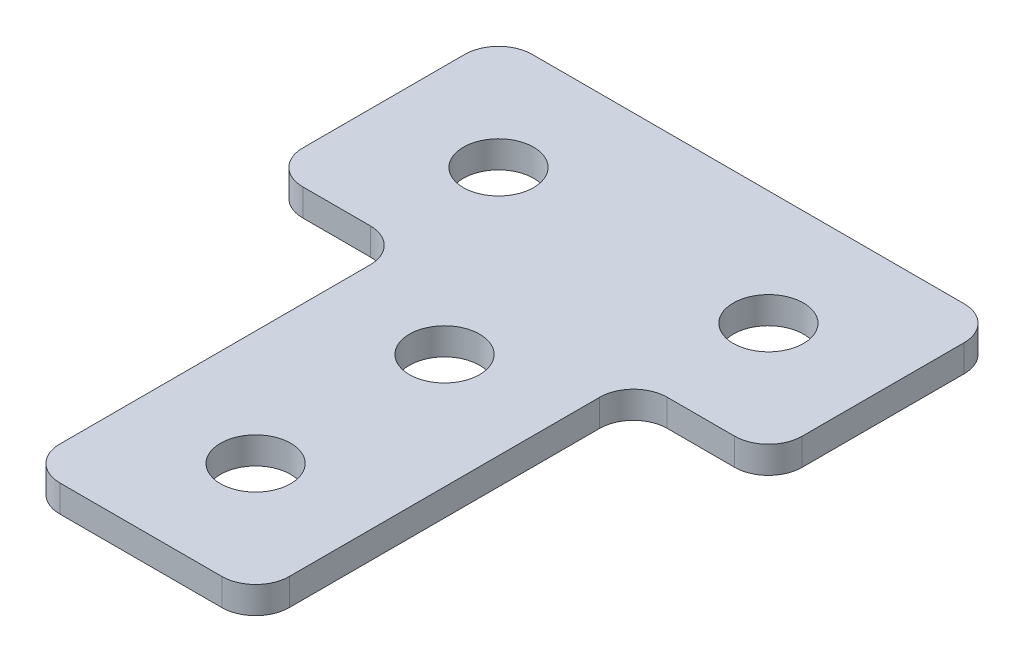
ISO-10303-21;
HEADER;
FILE_DESCRIPTION(('STEP AP214'),'2;1');
FILE_NAME('part.step','',(''),(''),'','','');
FILE_SCHEMA(('AUTOMOTIVE_DESIGN { 1 0 10303 214 1 1 1 1 }'));
ENDSEC;
DATA;
#1=APPLICATION_CONTEXT('core data for automotive mechanical design processes');
#2=APPLICATION_PROTOCOL_DEFINITION('international standard','automotive_design',2000,#1);
#3=PRODUCT_CONTEXT('',#1,'mechanical');
#4=PRODUCT('Part','Part','',(#3));
#5=PRODUCT_RELATED_PRODUCT_CATEGORY('part','',(#4));
#6=PRODUCT_DEFINITION_FORMATION('','',#4);
#7=PRODUCT_DEFINITION_CONTEXT('part definition',#1,'design');
#8=PRODUCT_DEFINITION('design','',#6,#7);
#9=PRODUCT_DEFINITION_SHAPE('','',#8);
#10=(LENGTH_UNIT() NAMED_UNIT(*) SI_UNIT(.MILLI.,.METRE.));
#11=(NAMED_UNIT(*) PLANE_ANGLE_UNIT() SI_UNIT($,.RADIAN.));
#12=(NAMED_UNIT(*) SI_UNIT($,.STERADIAN.) SOLID_ANGLE_UNIT());
#13=UNCERTAINTY_MEASURE_WITH_UNIT(LENGTH_MEASURE(1.E-05),#10,'distance_accuracy_value','');
#14=(GEOMETRIC_REPRESENTATION_CONTEXT(3) GLOBAL_UNCERTAINTY_ASSIGNED_CONTEXT((#13)) GLOBAL_UNIT_ASSIGNED_CONTEXT((#10,
#11,#12)) REPRESENTATION_CONTEXT('',''));
#15=CARTESIAN_POINT('',(0.,0.,0.));
#16=DIRECTION('',(0.,0.,1.));
#17=DIRECTION('',(1.,0.,0.));
#18=AXIS2_PLACEMENT_3D('',#15,#16,#17);
#19=CARTESIAN_POINT('',(30.5676190476191,-1.,-16.4609523809523));
#20=DIRECTION('',(0.,-1.,0.));
#21=DIRECTION('',(0.,0.,-1.));
#22=AXIS2_PLACEMENT_3D('',#19,#20,#21);
#23=PLANE('',#22);
#24=CARTESIAN_POINT('',(30.5676190476191,-1.,-2.46095238095234));
#25=DIRECTION('',(0.,1.,0.));
#26=DIRECTION('',(0.,0.,1.));
#27=AXIS2_PLACEMENT_3D('',#24,#25,#26);
#28=CIRCLE('',#27,2.6);
#29=CARTESIAN_POINT('',(30.5676190476191,-1.,0.139047619047657));
#30=VERTEX_POINT('',#29);
#31=EDGE_CURVE('E265',#30,#30,#28,.T.);
#32=ORIENTED_EDGE('',*,*,#31,.T.);
#33=EDGE_LOOP('',(#32));
#34=FACE_BOUND('',#33,.T.);
#35=DIRECTION('',(0.,0.,-1.));
#36=VECTOR('',#35,1.);
#37=CARTESIAN_POINT('',(49.067619047619,-1.,-7.96095238095231));
#38=LINE('',#37,#36);
#39=CARTESIAN_POINT('',(49.067619047619,-1.,-10.4609523809523));
#40=VERTEX_POINT('',#39);
#41=CARTESIAN_POINT('',(49.067619047619,-1.,-22.4609523809524));
#42=VERTEX_POINT('',#41);
#43=EDGE_CURVE('E279',#40,#42,#38,.T.);
#44=ORIENTED_EDGE('',*,*,#43,.F.);
#45=CARTESIAN_POINT('',(46.567619047619,-1.,-10.4609523809523));
#46=DIRECTION('',(0.,-1.,0.));
#47=DIRECTION('',(0.,0.,-1.));
#48=AXIS2_PLACEMENT_3D('',#45,#46,#47);
#49=CIRCLE('',#48,2.5);
#50=CARTESIAN_POINT('',(46.567619047619,-1.,-7.96095238095231));
#51=VERTEX_POINT('',#50);
#52=EDGE_CURVE('E190',#40,#51,#49,.T.);
#53=ORIENTED_EDGE('',*,*,#52,.T.);
#54=DIRECTION('',(1.,0.,0.));
#55=VECTOR('',#54,1.);
#56=CARTESIAN_POINT('',(39.0676190476191,-1.,-7.96095238095231));
#57=LINE('',#56,#55);
#58=CARTESIAN_POINT('',(41.5676190476191,-1.,-7.96095238095231));
#59=VERTEX_POINT('',#58);
#60=EDGE_CURVE('E153',#59,#51,#57,.T.);
#61=ORIENTED_EDGE('',*,*,#60,.F.);
#62=CARTESIAN_POINT('',(41.5676190476191,-1.,-5.46095238095231));
#63=DIRECTION('',(0.,-1.,0.));
#64=DIRECTION('',(0.,0.,-1.));
#65=AXIS2_PLACEMENT_3D('',#62,#63,#64);
#66=CIRCLE('',#65,2.5);
#67=CARTESIAN_POINT('',(39.0676190476191,-1.,-5.4609523809523));
#68=VERTEX_POINT('',#67);
#69=EDGE_CURVE('E217',#59,#68,#66,.F.);
#70=ORIENTED_EDGE('',*,*,#69,.T.);
#71=DIRECTION('',(0.,0.,-1.));
#72=VECTOR('',#71,1.);
#73=CARTESIAN_POINT('',(39.0676190476191,-1.,20.0390476190476));
#74=LINE('',#73,#72);
#75=CARTESIAN_POINT('',(39.0676190476191,-1.,17.5390476190476));
#76=VERTEX_POINT('',#75);
#77=EDGE_CURVE('E157',#76,#68,#74,.T.);
#78=ORIENTED_EDGE('',*,*,#77,.F.);
#79=CARTESIAN_POINT('',(36.5676190476191,-1.,17.5390476190476));
#80=DIRECTION('',(0.,-1.,0.));
#81=DIRECTION('',(0.,0.,-1.));
#82=AXIS2_PLACEMENT_3D('',#79,#80,#81);
#83=CIRCLE('',#82,2.5);
#84=CARTESIAN_POINT('',(36.5676190476191,-1.,20.0390476190476));
#85=VERTEX_POINT('',#84);
#86=EDGE_CURVE('E156',#76,#85,#83,.T.);
#87=ORIENTED_EDGE('',*,*,#86,.T.);
#88=DIRECTION('',(1.,0.,0.));
#89=VECTOR('',#88,1.);
#90=CARTESIAN_POINT('',(22.067619047619,-1.,20.0390476190476));
#91=LINE('',#90,#89);
#92=CARTESIAN_POINT('',(24.567619047619,-1.,20.0390476190476));
#93=VERTEX_POINT('',#92);
#94=EDGE_CURVE('E161',#93,#85,#91,.T.);
#95=ORIENTED_EDGE('',*,*,#94,.F.);
#96=CARTESIAN_POINT('',(24.567619047619,-1.,17.5390476190476));
#97=DIRECTION('',(0.,-1.,0.));
#98=DIRECTION('',(0.,0.,-1.));
#99=AXIS2_PLACEMENT_3D('',#96,#97,#98);
#100=CIRCLE('',#99,2.5);
#101=CARTESIAN_POINT('',(22.067619047619,-1.,17.5390476190476));
#102=VERTEX_POINT('',#101);
#103=EDGE_CURVE('E183',#93,#102,#100,.T.);
#104=ORIENTED_EDGE('',*,*,#103,.T.);
#105=DIRECTION('',(0.,0.,-1.));
#106=VECTOR('',#105,1.);
#107=CARTESIAN_POINT('',(22.067619047619,-1.,20.0390476190476));
#108=LINE('',#107,#106);
#109=CARTESIAN_POINT('',(22.067619047619,-1.,-5.4609523809523));
#110=VERTEX_POINT('',#109);
#111=EDGE_CURVE('E242',#102,#110,#108,.T.);
#112=ORIENTED_EDGE('',*,*,#111,.T.);
#113=CARTESIAN_POINT('',(19.567619047619,-1.,-5.4609523809523));
#114=DIRECTION('',(0.,-1.,0.));
#115=DIRECTION('',(0.,0.,-1.));
#116=AXIS2_PLACEMENT_3D('',#113,#114,#115);
#117=CIRCLE('',#116,2.5);
#118=CARTESIAN_POINT('',(19.567619047619,-1.,-7.96095238095231));
#119=VERTEX_POINT('',#118);
#120=EDGE_CURVE('E10',#110,#119,#117,.F.);
#121=ORIENTED_EDGE('',*,*,#120,.T.);
#122=DIRECTION('',(-1.,0.,0.));
#123=VECTOR('',#122,1.);
#124=CARTESIAN_POINT('',(22.067619047619,-1.,-7.96095238095231));
#125=LINE('',#124,#123);
#126=CARTESIAN_POINT('',(14.5676190476191,-1.,-7.9609523809523));
#127=VERTEX_POINT('',#126);
#128=EDGE_CURVE('E232',#119,#127,#125,.T.);
#129=ORIENTED_EDGE('',*,*,#128,.T.);
#130=CARTESIAN_POINT('',(14.5676190476191,-1.,-10.4609523809523));
#131=DIRECTION('',(0.,-1.,0.));
#132=DIRECTION('',(0.,0.,-1.));
#133=AXIS2_PLACEMENT_3D('',#130,#131,#132);
#134=CIRCLE('',#133,2.5);
#135=CARTESIAN_POINT('',(12.0676190476191,-1.,-10.4609523809523));
#136=VERTEX_POINT('',#135);
#137=EDGE_CURVE('E185',#127,#136,#134,.T.);
#138=ORIENTED_EDGE('',*,*,#137,.T.);
#139=DIRECTION('',(0.,0.,-1.));
#140=VECTOR('',#139,1.);
#141=CARTESIAN_POINT('',(12.0676190476191,-1.,-7.9609523809523));
#142=LINE('',#141,#140);
#143=CARTESIAN_POINT('',(12.0676190476191,-1.,-22.4609523809524));
#144=VERTEX_POINT('',#143);
#145=EDGE_CURVE('E246',#136,#144,#142,.T.);
#146=ORIENTED_EDGE('',*,*,#145,.T.);
#147=CARTESIAN_POINT('',(14.5676190476191,-1.,-22.4609523809524));
#148=DIRECTION('',(0.,-1.,0.));
#149=DIRECTION('',(0.,0.,-1.));
#150=AXIS2_PLACEMENT_3D('',#147,#148,#149);
#151=CIRCLE('',#150,2.5);
#152=CARTESIAN_POINT('',(14.5676190476191,-1.,-24.9609523809524));
#153=VERTEX_POINT('',#152);
#154=EDGE_CURVE('E31',#144,#153,#151,.T.);
#155=ORIENTED_EDGE('',*,*,#154,.T.);
#156=DIRECTION('',(-1.,0.,0.));
#157=VECTOR('',#156,1.);
#158=CARTESIAN_POINT('',(49.067619047619,-1.,-24.9609523809524));
#159=LINE('',#158,#157);
#160=CARTESIAN_POINT('',(46.567619047619,-1.,-24.9609523809524));
#161=VERTEX_POINT('',#160);
#162=EDGE_CURVE('E282',#161,#153,#159,.T.);
#163=ORIENTED_EDGE('',*,*,#162,.F.);
#164=CARTESIAN_POINT('',(46.567619047619,-1.,-22.4609523809524));
#165=DIRECTION('',(0.,-1.,0.));
#166=DIRECTION('',(0.,0.,-1.));
#167=AXIS2_PLACEMENT_3D('',#164,#165,#166);
#168=CIRCLE('',#167,2.5);
#169=EDGE_CURVE('E188',#161,#42,#168,.T.);
#170=ORIENTED_EDGE('',*,*,#169,.T.);
#171=EDGE_LOOP('',(#44,#53,#61,#70,#78,#87,#95,#104,#112,#121,#129,#138,#146,#155,#163,#170));
#172=FACE_BOUND('',#171,.T.);
#173=CARTESIAN_POINT('',(30.5676190476191,-1.,11.5390476190477));
#174=DIRECTION('',(0.,1.,0.));
#175=DIRECTION('',(0.,0.,1.));
#176=AXIS2_PLACEMENT_3D('',#173,#174,#175);
#177=CIRCLE('',#176,2.6);
#178=CARTESIAN_POINT('',(30.5676190476191,-1.,14.1390476190477));
#179=VERTEX_POINT('',#178);
#180=EDGE_CURVE('E259',#179,#179,#177,.T.);
#181=ORIENTED_EDGE('',*,*,#180,.T.);
#182=EDGE_LOOP('',(#181));
#183=FACE_BOUND('',#182,.T.);
#184=CARTESIAN_POINT('',(40.5676190476191,-1.,-16.4609523809523));
#185=DIRECTION('',(0.,1.,0.));
#186=DIRECTION('',(0.,0.,1.));
#187=AXIS2_PLACEMENT_3D('',#184,#185,#186);
#188=CIRCLE('',#187,2.6);
#189=CARTESIAN_POINT('',(40.5676190476191,-1.,-13.8609523809523));
#190=VERTEX_POINT('',#189);
#191=EDGE_CURVE('E271',#190,#190,#188,.T.);
#192=ORIENTED_EDGE('',*,*,#191,.T.);
#193=EDGE_LOOP('',(#192));
#194=FACE_BOUND('',#193,.T.);
#195=CARTESIAN_POINT('',(20.5676190476191,-1.,-16.4609523809523));
#196=DIRECTION('',(0.,-1.,0.));
#197=DIRECTION('',(0.,0.,1.));
#198=AXIS2_PLACEMENT_3D('',#195,#196,#197);
#199=CIRCLE('',#198,2.6);
#200=CARTESIAN_POINT('',(20.5676190476191,-1.,-13.8609523809523));
#201=VERTEX_POINT('',#200);
#202=EDGE_CURVE('E256',#201,#201,#199,.T.);
#203=ORIENTED_EDGE('',*,*,#202,.F.);
#204=EDGE_LOOP('',(#203));
#205=FACE_BOUND('',#204,.T.);
#206=ADVANCED_FACE('F16',(#34,#172,#183,#194,#205),#23,.T.);
#207=CARTESIAN_POINT('',(39.0676190476191,-1.,-7.96095238095231));
#208=DIRECTION('',(0.,0.,1.));
#209=DIRECTION('',(1.,0.,0.));
#210=AXIS2_PLACEMENT_3D('',#207,#208,#209);
#211=PLANE('',#210);
#212=DIRECTION('',(1.,0.,0.));
#213=VECTOR('',#212,1.);
#214=CARTESIAN_POINT('',(39.0676190476191,1.,-7.96095238095231));
#215=LINE('',#214,#213);
#216=CARTESIAN_POINT('',(41.5676190476191,1.,-7.96095238095231));
#217=VERTEX_POINT('',#216);
#218=CARTESIAN_POINT('',(46.567619047619,1.,-7.96095238095231));
#219=VERTEX_POINT('',#218);
#220=EDGE_CURVE('E274',#217,#219,#215,.T.);
#221=ORIENTED_EDGE('',*,*,#220,.F.);
#222=DIRECTION('',(0.,1.,0.));
#223=VECTOR('',#222,1.);
#224=CARTESIAN_POINT('',(41.5676190476191,-1.,-7.96095238095231));
#225=LINE('',#224,#223);
#226=EDGE_CURVE('E143',#217,#59,#225,.F.);
#227=ORIENTED_EDGE('',*,*,#226,.T.);
#228=ORIENTED_EDGE('',*,*,#60,.T.);
#229=DIRECTION('',(0.,1.,0.));
#230=VECTOR('',#229,1.);
#231=CARTESIAN_POINT('',(46.567619047619,-1.,-7.96095238095231));
#232=LINE('',#231,#230);
#233=EDGE_CURVE('E159',#51,#219,#232,.T.);
#234=ORIENTED_EDGE('',*,*,#233,.T.);
#235=EDGE_LOOP('',(#221,#227,#228,#234));
#236=FACE_BOUND('',#235,.T.);
#237=ADVANCED_FACE('F311',(#236),#211,.T.);
#238=CARTESIAN_POINT('',(39.0676190476191,-1.,20.0390476190476));
#239=DIRECTION('',(1.,0.,0.));
#240=DIRECTION('',(0.,0.,-1.));
#241=AXIS2_PLACEMENT_3D('',#238,#239,#240);
#242=PLANE('',#241);
#243=ORIENTED_EDGE('',*,*,#77,.T.);
#244=DIRECTION('',(0.,1.,0.));
#245=VECTOR('',#244,1.);
#246=CARTESIAN_POINT('',(39.0676190476191,1.,-5.46095238095231));
#247=LINE('',#246,#245);
#248=CARTESIAN_POINT('',(39.0676190476191,1.,-5.4609523809523));
#249=VERTEX_POINT('',#248);
#250=EDGE_CURVE('E152',#68,#249,#247,.T.);
#251=ORIENTED_EDGE('',*,*,#250,.T.);
#252=DIRECTION('',(0.,0.,-1.));
#253=VECTOR('',#252,1.);
#254=CARTESIAN_POINT('',(39.0676190476191,1.,20.0390476190476));
#255=LINE('',#254,#253);
#256=CARTESIAN_POINT('',(39.0676190476191,1.,17.5390476190476));
#257=VERTEX_POINT('',#256);
#258=EDGE_CURVE('E135',#257,#249,#255,.T.);
#259=ORIENTED_EDGE('',*,*,#258,.F.);
#260=DIRECTION('',(0.,1.,0.));
#261=VECTOR('',#260,1.);
#262=CARTESIAN_POINT('',(39.0676190476191,-1.,17.5390476190476));
#263=LINE('',#262,#261);
#264=EDGE_CURVE('E149',#257,#76,#263,.F.);
#265=ORIENTED_EDGE('',*,*,#264,.T.);
#266=EDGE_LOOP('',(#243,#251,#259,#265));
#267=FACE_BOUND('',#266,.T.);
#268=ADVANCED_FACE('F148',(#267),#242,.T.);
#269=CARTESIAN_POINT('',(22.067619047619,-1.,20.0390476190476));
#270=DIRECTION('',(0.,0.,1.));
#271=DIRECTION('',(1.,0.,0.));
#272=AXIS2_PLACEMENT_3D('',#269,#270,#271);
#273=PLANE('',#272);
#274=DIRECTION('',(1.,0.,0.));
#275=VECTOR('',#274,1.);
#276=CARTESIAN_POINT('',(22.067619047619,1.,20.0390476190476));
#277=LINE('',#276,#275);
#278=CARTESIAN_POINT('',(24.567619047619,1.,20.0390476190476));
#279=VERTEX_POINT('',#278);
#280=CARTESIAN_POINT('',(36.5676190476191,1.,20.0390476190476));
#281=VERTEX_POINT('',#280);
#282=EDGE_CURVE('E137',#279,#281,#277,.T.);
#283=ORIENTED_EDGE('',*,*,#282,.F.);
#284=DIRECTION('',(0.,1.,0.));
#285=VECTOR('',#284,1.);
#286=CARTESIAN_POINT('',(24.567619047619,-1.,20.0390476190476));
#287=LINE('',#286,#285);
#288=EDGE_CURVE('E213',#279,#93,#287,.F.);
#289=ORIENTED_EDGE('',*,*,#288,.T.);
#290=ORIENTED_EDGE('',*,*,#94,.T.);
#291=DIRECTION('',(0.,1.,0.));
#292=VECTOR('',#291,1.);
#293=CARTESIAN_POINT('',(36.5676190476191,-1.,20.0390476190476));
#294=LINE('',#293,#292);
#295=EDGE_CURVE('E211',#85,#281,#294,.T.);
#296=ORIENTED_EDGE('',*,*,#295,.T.);
#297=EDGE_LOOP('',(#283,#289,#290,#296));
#298=FACE_BOUND('',#297,.T.);
#299=ADVANCED_FACE('F318',(#298),#273,.T.);
#300=CARTESIAN_POINT('',(49.067619047619,-1.,-24.9609523809524));
#301=DIRECTION('',(0.,0.,-1.));
#302=DIRECTION('',(-1.,0.,0.));
#303=AXIS2_PLACEMENT_3D('',#300,#301,#302);
#304=PLANE('',#303);
#305=DIRECTION('',(-1.,0.,0.));
#306=VECTOR('',#305,1.);
#307=CARTESIAN_POINT('',(49.067619047619,1.,-24.9609523809524));
#308=LINE('',#307,#306);
#309=CARTESIAN_POINT('',(46.567619047619,1.,-24.9609523809524));
#310=VERTEX_POINT('',#309);
#311=CARTESIAN_POINT('',(14.5676190476191,1.,-24.9609523809524));
#312=VERTEX_POINT('',#311);
#313=EDGE_CURVE('E290',#310,#312,#308,.T.);
#314=ORIENTED_EDGE('',*,*,#313,.F.);
#315=DIRECTION('',(0.,1.,0.));
#316=VECTOR('',#315,1.);
#317=CARTESIAN_POINT('',(46.567619047619,-1.,-24.9609523809524));
#318=LINE('',#317,#316);
#319=EDGE_CURVE('E38',#310,#161,#318,.F.);
#320=ORIENTED_EDGE('',*,*,#319,.T.);
#321=ORIENTED_EDGE('',*,*,#162,.T.);
#322=DIRECTION('',(0.,1.,0.));
#323=VECTOR('',#322,1.);
#324=CARTESIAN_POINT('',(14.5676190476191,-1.,-24.9609523809524));
#325=LINE('',#324,#323);
#326=EDGE_CURVE('E192',#153,#312,#325,.T.);
#327=ORIENTED_EDGE('',*,*,#326,.T.);
#328=EDGE_LOOP('',(#314,#320,#321,#327));
#329=FACE_BOUND('',#328,.T.);
#330=ADVANCED_FACE('F293',(#329),#304,.T.);
#331=CARTESIAN_POINT('',(49.067619047619,-1.,-7.96095238095231));
#332=DIRECTION('',(1.,0.,0.));
#333=DIRECTION('',(0.,0.,-1.));
#334=AXIS2_PLACEMENT_3D('',#331,#332,#333);
#335=PLANE('',#334);
#336=DIRECTION('',(0.,0.,-1.));
#337=VECTOR('',#336,1.);
#338=CARTESIAN_POINT('',(49.067619047619,1.,-7.96095238095231));
#339=LINE('',#338,#337);
#340=CARTESIAN_POINT('',(49.067619047619,1.,-10.4609523809523));
#341=VERTEX_POINT('',#340);
#342=CARTESIAN_POINT('',(49.067619047619,1.,-22.4609523809524));
#343=VERTEX_POINT('',#342);
#344=EDGE_CURVE('E287',#341,#343,#339,.T.);
#345=ORIENTED_EDGE('',*,*,#344,.F.);
#346=DIRECTION('',(0.,1.,0.));
#347=VECTOR('',#346,1.);
#348=CARTESIAN_POINT('',(49.067619047619,-1.,-10.4609523809523));
#349=LINE('',#348,#347);
#350=EDGE_CURVE('E180',#341,#40,#349,.F.);
#351=ORIENTED_EDGE('',*,*,#350,.T.);
#352=ORIENTED_EDGE('',*,*,#43,.T.);
#353=DIRECTION('',(0.,1.,0.));
#354=VECTOR('',#353,1.);
#355=CARTESIAN_POINT('',(49.067619047619,-1.,-22.4609523809524));
#356=LINE('',#355,#354);
#357=EDGE_CURVE('E177',#42,#343,#356,.T.);
#358=ORIENTED_EDGE('',*,*,#357,.T.);
#359=EDGE_LOOP('',(#345,#351,#352,#358));
#360=FACE_BOUND('',#359,.T.);
#361=ADVANCED_FACE('F302',(#360),#335,.T.);
#362=CARTESIAN_POINT('',(30.5676190476191,1.,-16.4609523809523));
#363=DIRECTION('',(0.,-1.,0.));
#364=DIRECTION('',(0.,0.,-1.));
#365=AXIS2_PLACEMENT_3D('',#362,#363,#364);
#366=PLANE('',#365);
#367=CARTESIAN_POINT('',(30.5676190476191,1.,-2.46095238095234));
#368=DIRECTION('',(0.,1.,0.));
#369=DIRECTION('',(0.,0.,1.));
#370=AXIS2_PLACEMENT_3D('',#367,#368,#369);
#371=CIRCLE('',#370,2.6);
#372=CARTESIAN_POINT('',(30.5676190476191,1.,0.139047619047657));
#373=VERTEX_POINT('',#372);
#374=EDGE_CURVE('E262',#373,#373,#371,.T.);
#375=ORIENTED_EDGE('',*,*,#374,.F.);
#376=EDGE_LOOP('',(#375));
#377=FACE_BOUND('',#376,.T.);
#378=ORIENTED_EDGE('',*,*,#220,.T.);
#379=CARTESIAN_POINT('',(46.567619047619,1.,-10.4609523809523));
#380=DIRECTION('',(0.,-1.,0.));
#381=DIRECTION('',(0.,0.,-1.));
#382=AXIS2_PLACEMENT_3D('',#379,#380,#381);
#383=CIRCLE('',#382,2.5);
#384=EDGE_CURVE('E175',#219,#341,#383,.F.);
#385=ORIENTED_EDGE('',*,*,#384,.T.);
#386=ORIENTED_EDGE('',*,*,#344,.T.);
#387=CARTESIAN_POINT('',(46.567619047619,1.,-22.4609523809524));
#388=DIRECTION('',(0.,-1.,0.));
#389=DIRECTION('',(0.,0.,-1.));
#390=AXIS2_PLACEMENT_3D('',#387,#388,#389);
#391=CIRCLE('',#390,2.5);
#392=EDGE_CURVE('E173',#343,#310,#391,.F.);
#393=ORIENTED_EDGE('',*,*,#392,.T.);
#394=ORIENTED_EDGE('',*,*,#313,.T.);
#395=CARTESIAN_POINT('',(14.5676190476191,1.,-22.4609523809524));
#396=DIRECTION('',(0.,-1.,0.));
#397=DIRECTION('',(0.,0.,-1.));
#398=AXIS2_PLACEMENT_3D('',#395,#396,#397);
#399=CIRCLE('',#398,2.5);
#400=CARTESIAN_POINT('',(12.0676190476191,1.,-22.4609523809524));
#401=VERTEX_POINT('',#400);
#402=EDGE_CURVE('E171',#312,#401,#399,.F.);
#403=ORIENTED_EDGE('',*,*,#402,.T.);
#404=DIRECTION('',(0.,0.,-1.));
#405=VECTOR('',#404,1.);
#406=CARTESIAN_POINT('',(12.0676190476191,1.,-7.9609523809523));
#407=LINE('',#406,#405);
#408=CARTESIAN_POINT('',(12.0676190476191,1.,-10.4609523809523));
#409=VERTEX_POINT('',#408);
#410=EDGE_CURVE('E233',#409,#401,#407,.T.);
#411=ORIENTED_EDGE('',*,*,#410,.F.);
#412=CARTESIAN_POINT('',(14.5676190476191,1.,-10.4609523809523));
#413=DIRECTION('',(0.,-1.,0.));
#414=DIRECTION('',(0.,0.,-1.));
#415=AXIS2_PLACEMENT_3D('',#412,#413,#414);
#416=CIRCLE('',#415,2.5);
#417=CARTESIAN_POINT('',(14.5676190476191,1.,-7.9609523809523));
#418=VERTEX_POINT('',#417);
#419=EDGE_CURVE('E169',#409,#418,#416,.F.);
#420=ORIENTED_EDGE('',*,*,#419,.T.);
#421=DIRECTION('',(-1.,0.,0.));
#422=VECTOR('',#421,1.);
#423=CARTESIAN_POINT('',(22.067619047619,1.,-7.96095238095231));
#424=LINE('',#423,#422);
#425=CARTESIAN_POINT('',(19.567619047619,1.,-7.96095238095231));
#426=VERTEX_POINT('',#425);
#427=EDGE_CURVE('E223',#426,#418,#424,.T.);
#428=ORIENTED_EDGE('',*,*,#427,.F.);
#429=CARTESIAN_POINT('',(19.567619047619,1.,-5.4609523809523));
#430=DIRECTION('',(0.,-1.,0.));
#431=DIRECTION('',(0.,0.,-1.));
#432=AXIS2_PLACEMENT_3D('',#429,#430,#431);
#433=CIRCLE('',#432,2.5);
#434=CARTESIAN_POINT('',(22.067619047619,1.,-5.4609523809523));
#435=VERTEX_POINT('',#434);
#436=EDGE_CURVE('E24',#426,#435,#433,.T.);
#437=ORIENTED_EDGE('',*,*,#436,.T.);
#438=DIRECTION('',(0.,0.,-1.));
#439=VECTOR('',#438,1.);
#440=CARTESIAN_POINT('',(22.067619047619,1.,20.0390476190476));
#441=LINE('',#440,#439);
#442=CARTESIAN_POINT('',(22.067619047619,1.,17.5390476190476));
#443=VERTEX_POINT('',#442);
#444=EDGE_CURVE('E221',#443,#435,#441,.T.);
#445=ORIENTED_EDGE('',*,*,#444,.F.);
#446=CARTESIAN_POINT('',(24.567619047619,1.,17.5390476190476));
#447=DIRECTION('',(0.,-1.,0.));
#448=DIRECTION('',(0.,0.,-1.));
#449=AXIS2_PLACEMENT_3D('',#446,#447,#448);
#450=CIRCLE('',#449,2.5);
#451=EDGE_CURVE('E142',#443,#279,#450,.F.);
#452=ORIENTED_EDGE('',*,*,#451,.T.);
#453=ORIENTED_EDGE('',*,*,#282,.T.);
#454=CARTESIAN_POINT('',(36.5676190476191,1.,17.5390476190476));
#455=DIRECTION('',(0.,-1.,0.));
#456=DIRECTION('',(0.,0.,-1.));
#457=AXIS2_PLACEMENT_3D('',#454,#455,#456);
#458=CIRCLE('',#457,2.5);
#459=EDGE_CURVE('E130',#281,#257,#458,.F.);
#460=ORIENTED_EDGE('',*,*,#459,.T.);
#461=ORIENTED_EDGE('',*,*,#258,.T.);
#462=CARTESIAN_POINT('',(41.5676190476191,1.,-5.46095238095231));
#463=DIRECTION('',(0.,-1.,0.));
#464=DIRECTION('',(0.,0.,-1.));
#465=AXIS2_PLACEMENT_3D('',#462,#463,#464);
#466=CIRCLE('',#465,2.5);
#467=EDGE_CURVE('E215',#249,#217,#466,.T.);
#468=ORIENTED_EDGE('',*,*,#467,.T.);
#469=EDGE_LOOP('',(#378,#385,#386,#393,#394,#403,#411,#420,#428,#437,#445,#452,#453,#460,#461,#468));
#470=FACE_BOUND('',#469,.T.);
#471=CARTESIAN_POINT('',(30.5676190476191,1.,11.5390476190477));
#472=DIRECTION('',(0.,1.,0.));
#473=DIRECTION('',(0.,0.,1.));
#474=AXIS2_PLACEMENT_3D('',#471,#472,#473);
#475=CIRCLE('',#474,2.6);
#476=CARTESIAN_POINT('',(30.5676190476191,1.,14.1390476190477));
#477=VERTEX_POINT('',#476);
#478=EDGE_CURVE('E254',#477,#477,#475,.T.);
#479=ORIENTED_EDGE('',*,*,#478,.F.);
#480=EDGE_LOOP('',(#479));
#481=FACE_BOUND('',#480,.T.);
#482=CARTESIAN_POINT('',(40.5676190476191,1.,-16.4609523809523));
#483=DIRECTION('',(0.,1.,0.));
#484=DIRECTION('',(0.,0.,1.));
#485=AXIS2_PLACEMENT_3D('',#482,#483,#484);
#486=CIRCLE('',#485,2.6);
#487=CARTESIAN_POINT('',(40.5676190476191,1.,-13.8609523809523));
#488=VERTEX_POINT('',#487);
#489=EDGE_CURVE('E268',#488,#488,#486,.T.);
#490=ORIENTED_EDGE('',*,*,#489,.F.);
#491=EDGE_LOOP('',(#490));
#492=FACE_BOUND('',#491,.T.);
#493=CARTESIAN_POINT('',(20.5676190476191,1.,-16.4609523809523));
#494=DIRECTION('',(0.,-1.,0.));
#495=DIRECTION('',(0.,0.,1.));
#496=AXIS2_PLACEMENT_3D('',#493,#494,#495);
#497=CIRCLE('',#496,2.6);
#498=CARTESIAN_POINT('',(20.5676190476191,1.,-13.8609523809523));
#499=VERTEX_POINT('',#498);
#500=EDGE_CURVE('E250',#499,#499,#497,.T.);
#501=ORIENTED_EDGE('',*,*,#500,.T.);
#502=EDGE_LOOP('',(#501));
#503=FACE_BOUND('',#502,.T.);
#504=ADVANCED_FACE('F133',(#377,#470,#481,#492,#503),#366,.F.);
#505=CARTESIAN_POINT('',(40.5676190476191,-1.,-16.4609523809523));
#506=DIRECTION('',(0.,1.,0.));
#507=DIRECTION('',(0.,0.,1.));
#508=AXIS2_PLACEMENT_3D('',#505,#506,#507);
#509=CYLINDRICAL_SURFACE('',#508,2.6);
#510=ORIENTED_EDGE('',*,*,#191,.F.);
#511=EDGE_LOOP('',(#510));
#512=FACE_BOUND('',#511,.T.);
#513=ORIENTED_EDGE('',*,*,#489,.T.);
#514=EDGE_LOOP('',(#513));
#515=FACE_BOUND('',#514,.T.);
#516=ADVANCED_FACE('F378',(#512,#515),#509,.F.);
#517=CARTESIAN_POINT('',(30.5676190476191,-1.,-2.46095238095234));
#518=DIRECTION('',(0.,1.,0.));
#519=DIRECTION('',(0.,0.,1.));
#520=AXIS2_PLACEMENT_3D('',#517,#518,#519);
#521=CYLINDRICAL_SURFACE('',#520,2.6);
#522=ORIENTED_EDGE('',*,*,#31,.F.);
#523=EDGE_LOOP('',(#522));
#524=FACE_BOUND('',#523,.T.);
#525=ORIENTED_EDGE('',*,*,#374,.T.);
#526=EDGE_LOOP('',(#525));
#527=FACE_BOUND('',#526,.T.);
#528=ADVANCED_FACE('F374',(#524,#527),#521,.F.);
#529=CARTESIAN_POINT('',(30.5676190476191,-1.,11.5390476190477));
#530=DIRECTION('',(0.,1.,0.));
#531=DIRECTION('',(0.,0.,1.));
#532=AXIS2_PLACEMENT_3D('',#529,#530,#531);
#533=CYLINDRICAL_SURFACE('',#532,2.6);
#534=ORIENTED_EDGE('',*,*,#478,.T.);
#535=EDGE_LOOP('',(#534));
#536=FACE_BOUND('',#535,.T.);
#537=ORIENTED_EDGE('',*,*,#180,.F.);
#538=EDGE_LOOP('',(#537));
#539=FACE_BOUND('',#538,.T.);
#540=ADVANCED_FACE('F371',(#536,#539),#533,.F.);
#541=CARTESIAN_POINT('',(22.067619047619,-1.,-7.96095238095231));
#542=DIRECTION('',(0.,0.,1.));
#543=DIRECTION('',(-1.,0.,0.));
#544=AXIS2_PLACEMENT_3D('',#541,#542,#543);
#545=PLANE('',#544);
#546=ORIENTED_EDGE('',*,*,#427,.T.);
#547=DIRECTION('',(0.,1.,0.));
#548=VECTOR('',#547,1.);
#549=CARTESIAN_POINT('',(14.5676190476191,-1.,-7.9609523809523));
#550=LINE('',#549,#548);
#551=EDGE_CURVE('E204',#418,#127,#550,.F.);
#552=ORIENTED_EDGE('',*,*,#551,.T.);
#553=ORIENTED_EDGE('',*,*,#128,.F.);
#554=DIRECTION('',(0.,1.,0.));
#555=VECTOR('',#554,1.);
#556=CARTESIAN_POINT('',(19.567619047619,1.,-7.96095238095231));
#557=LINE('',#556,#555);
#558=EDGE_CURVE('E201',#119,#426,#557,.T.);
#559=ORIENTED_EDGE('',*,*,#558,.T.);
#560=EDGE_LOOP('',(#546,#552,#553,#559));
#561=FACE_BOUND('',#560,.T.);
#562=ADVANCED_FACE('F244',(#561),#545,.T.);
#563=CARTESIAN_POINT('',(22.067619047619,-1.,20.0390476190476));
#564=DIRECTION('',(-1.,0.,0.));
#565=DIRECTION('',(0.,0.,-1.));
#566=AXIS2_PLACEMENT_3D('',#563,#564,#565);
#567=PLANE('',#566);
#568=ORIENTED_EDGE('',*,*,#444,.T.);
#569=DIRECTION('',(0.,1.,0.));
#570=VECTOR('',#569,1.);
#571=CARTESIAN_POINT('',(22.067619047619,-1.,-5.4609523809523));
#572=LINE('',#571,#570);
#573=EDGE_CURVE('E209',#435,#110,#572,.F.);
#574=ORIENTED_EDGE('',*,*,#573,.T.);
#575=ORIENTED_EDGE('',*,*,#111,.F.);
#576=DIRECTION('',(0.,1.,0.));
#577=VECTOR('',#576,1.);
#578=CARTESIAN_POINT('',(22.067619047619,-1.,17.5390476190476));
#579=LINE('',#578,#577);
#580=EDGE_CURVE('E206',#102,#443,#579,.T.);
#581=ORIENTED_EDGE('',*,*,#580,.T.);
#582=EDGE_LOOP('',(#568,#574,#575,#581));
#583=FACE_BOUND('',#582,.T.);
#584=ADVANCED_FACE('F228',(#583),#567,.T.);
#585=CARTESIAN_POINT('',(12.0676190476191,-1.,-7.9609523809523));
#586=DIRECTION('',(-1.,0.,0.));
#587=DIRECTION('',(0.,0.,-1.));
#588=AXIS2_PLACEMENT_3D('',#585,#586,#587);
#589=PLANE('',#588);
#590=ORIENTED_EDGE('',*,*,#410,.T.);
#591=DIRECTION('',(0.,1.,0.));
#592=VECTOR('',#591,1.);
#593=CARTESIAN_POINT('',(12.0676190476191,-1.,-22.4609523809524));
#594=LINE('',#593,#592);
#595=EDGE_CURVE('E199',#401,#144,#594,.F.);
#596=ORIENTED_EDGE('',*,*,#595,.T.);
#597=ORIENTED_EDGE('',*,*,#145,.F.);
#598=DIRECTION('',(0.,1.,0.));
#599=VECTOR('',#598,1.);
#600=CARTESIAN_POINT('',(12.0676190476191,-1.,-10.4609523809523));
#601=LINE('',#600,#599);
#602=EDGE_CURVE('E196',#136,#409,#601,.T.);
#603=ORIENTED_EDGE('',*,*,#602,.T.);
#604=EDGE_LOOP('',(#590,#596,#597,#603));
#605=FACE_BOUND('',#604,.T.);
#606=ADVANCED_FACE('F357',(#605),#589,.T.);
#607=CARTESIAN_POINT('',(20.5676190476191,-1.,-16.4609523809523));
#608=DIRECTION('',(0.,1.,0.));
#609=DIRECTION('',(0.,0.,1.));
#610=AXIS2_PLACEMENT_3D('',#607,#608,#609);
#611=CYLINDRICAL_SURFACE('',#610,2.6);
#612=ORIENTED_EDGE('',*,*,#202,.T.);
#613=EDGE_LOOP('',(#612));
#614=FACE_BOUND('',#613,.T.);
#615=ORIENTED_EDGE('',*,*,#500,.F.);
#616=EDGE_LOOP('',(#615));
#617=FACE_BOUND('',#616,.T.);
#618=ADVANCED_FACE('F341',(#614,#617),#611,.F.);
#619=CARTESIAN_POINT('',(41.5676190476191,-1.,-5.46095238095231));
#620=DIRECTION('',(0.,-1.,0.));
#621=DIRECTION('',(0.,0.,-1.));
#622=AXIS2_PLACEMENT_3D('',#619,#620,#621);
#623=CYLINDRICAL_SURFACE('',#622,2.5);
#624=ORIENTED_EDGE('',*,*,#69,.F.);
#625=ORIENTED_EDGE('',*,*,#226,.F.);
#626=ORIENTED_EDGE('',*,*,#467,.F.);
#627=ORIENTED_EDGE('',*,*,#250,.F.);
#628=EDGE_LOOP('',(#624,#625,#626,#627));
#629=FACE_BOUND('',#628,.T.);
#630=ADVANCED_FACE('F314',(#629),#623,.F.);
#631=CARTESIAN_POINT('',(46.567619047619,-1.,-10.4609523809523));
#632=DIRECTION('',(0.,1.,0.));
#633=DIRECTION('',(0.,0.,1.));
#634=AXIS2_PLACEMENT_3D('',#631,#632,#633);
#635=CYLINDRICAL_SURFACE('',#634,2.5);
#636=ORIENTED_EDGE('',*,*,#52,.F.);
#637=ORIENTED_EDGE('',*,*,#350,.F.);
#638=ORIENTED_EDGE('',*,*,#384,.F.);
#639=ORIENTED_EDGE('',*,*,#233,.F.);
#640=EDGE_LOOP('',(#636,#637,#638,#639));
#641=FACE_BOUND('',#640,.T.);
#642=ADVANCED_FACE('F305',(#641),#635,.T.);
#643=CARTESIAN_POINT('',(46.567619047619,-1.,-22.4609523809524));
#644=DIRECTION('',(0.,1.,0.));
#645=DIRECTION('',(0.,0.,1.));
#646=AXIS2_PLACEMENT_3D('',#643,#644,#645);
#647=CYLINDRICAL_SURFACE('',#646,2.5);
#648=ORIENTED_EDGE('',*,*,#169,.F.);
#649=ORIENTED_EDGE('',*,*,#319,.F.);
#650=ORIENTED_EDGE('',*,*,#392,.F.);
#651=ORIENTED_EDGE('',*,*,#357,.F.);
#652=EDGE_LOOP('',(#648,#649,#650,#651));
#653=FACE_BOUND('',#652,.T.);
#654=ADVANCED_FACE('F297',(#653),#647,.T.);
#655=CARTESIAN_POINT('',(14.5676190476191,-1.,-22.4609523809524));
#656=DIRECTION('',(0.,1.,0.));
#657=DIRECTION('',(0.,0.,1.));
#658=AXIS2_PLACEMENT_3D('',#655,#656,#657);
#659=CYLINDRICAL_SURFACE('',#658,2.5);
#660=ORIENTED_EDGE('',*,*,#154,.F.);
#661=ORIENTED_EDGE('',*,*,#595,.F.);
#662=ORIENTED_EDGE('',*,*,#402,.F.);
#663=ORIENTED_EDGE('',*,*,#326,.F.);
#664=EDGE_LOOP('',(#660,#661,#662,#663));
#665=FACE_BOUND('',#664,.T.);
#666=ADVANCED_FACE('F346',(#665),#659,.T.);
#667=CARTESIAN_POINT('',(14.5676190476191,-1.,-10.4609523809523));
#668=DIRECTION('',(0.,1.,0.));
#669=DIRECTION('',(0.,0.,1.));
#670=AXIS2_PLACEMENT_3D('',#667,#668,#669);
#671=CYLINDRICAL_SURFACE('',#670,2.5);
#672=ORIENTED_EDGE('',*,*,#137,.F.);
#673=ORIENTED_EDGE('',*,*,#551,.F.);
#674=ORIENTED_EDGE('',*,*,#419,.F.);
#675=ORIENTED_EDGE('',*,*,#602,.F.);
#676=EDGE_LOOP('',(#672,#673,#674,#675));
#677=FACE_BOUND('',#676,.T.);
#678=ADVANCED_FACE('F328',(#677),#671,.T.);
#679=CARTESIAN_POINT('',(19.567619047619,-1.,-5.4609523809523));
#680=DIRECTION('',(0.,-1.,0.));
#681=DIRECTION('',(0.,0.,-1.));
#682=AXIS2_PLACEMENT_3D('',#679,#680,#681);
#683=CYLINDRICAL_SURFACE('',#682,2.5);
#684=ORIENTED_EDGE('',*,*,#120,.F.);
#685=ORIENTED_EDGE('',*,*,#573,.F.);
#686=ORIENTED_EDGE('',*,*,#436,.F.);
#687=ORIENTED_EDGE('',*,*,#558,.F.);
#688=EDGE_LOOP('',(#684,#685,#686,#687));
#689=FACE_BOUND('',#688,.T.);
#690=ADVANCED_FACE('F236',(#689),#683,.F.);
#691=CARTESIAN_POINT('',(24.567619047619,-1.,17.5390476190476));
#692=DIRECTION('',(0.,1.,0.));
#693=DIRECTION('',(0.,0.,1.));
#694=AXIS2_PLACEMENT_3D('',#691,#692,#693);
#695=CYLINDRICAL_SURFACE('',#694,2.5);
#696=ORIENTED_EDGE('',*,*,#103,.F.);
#697=ORIENTED_EDGE('',*,*,#288,.F.);
#698=ORIENTED_EDGE('',*,*,#451,.F.);
#699=ORIENTED_EDGE('',*,*,#580,.F.);
#700=EDGE_LOOP('',(#696,#697,#698,#699));
#701=FACE_BOUND('',#700,.T.);
#702=ADVANCED_FACE('F321',(#701),#695,.T.);
#703=CARTESIAN_POINT('',(36.5676190476191,-1.,17.5390476190476));
#704=DIRECTION('',(0.,1.,0.));
#705=DIRECTION('',(0.,0.,1.));
#706=AXIS2_PLACEMENT_3D('',#703,#704,#705);
#707=CYLINDRICAL_SURFACE('',#706,2.5);
#708=ORIENTED_EDGE('',*,*,#86,.F.);
#709=ORIENTED_EDGE('',*,*,#264,.F.);
#710=ORIENTED_EDGE('',*,*,#459,.F.);
#711=ORIENTED_EDGE('',*,*,#295,.F.);
#712=EDGE_LOOP('',(#708,#709,#710,#711));
#713=FACE_BOUND('',#712,.T.);
#714=ADVANCED_FACE('F18',(#713),#707,.T.);
#715=CLOSED_SHELL('',(#206,#237,#268,#299,#330,#361,#504,#516,#528,#540,#562,#584,#606,#618,
#630,#642,#654,#666,#678,#690,#702,#714));
#716=MANIFOLD_SOLID_BREP('B1',#715);
#717=ADVANCED_BREP_SHAPE_REPRESENTATION('',(#18,#716),#14);
#718=SHAPE_DEFINITION_REPRESENTATION(#9,#717);
ENDSEC;
END-ISO-10303-21;
